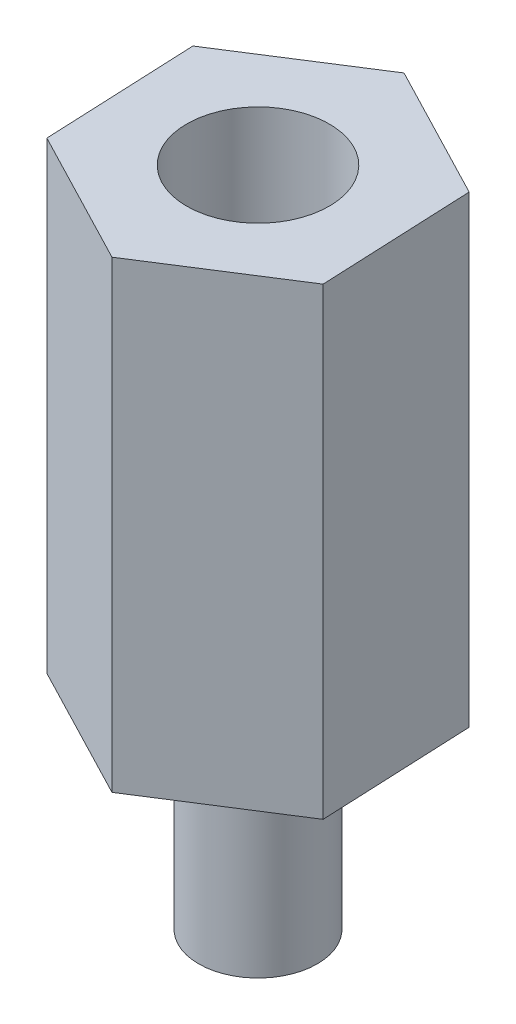
ISO-10303-21;
HEADER;
FILE_DESCRIPTION(('STEP AP214'),'2;1');
FILE_NAME('part.step','',(''),(''),'','','');
FILE_SCHEMA(('AUTOMOTIVE_DESIGN { 1 0 10303 214 1 1 1 1 }'));
ENDSEC;
DATA;
#1=APPLICATION_CONTEXT('core data for automotive mechanical design processes');
#2=APPLICATION_PROTOCOL_DEFINITION('international standard','automotive_design',2000,#1);
#3=PRODUCT_CONTEXT('',#1,'mechanical');
#4=PRODUCT('Part','Part','',(#3));
#5=PRODUCT_RELATED_PRODUCT_CATEGORY('part','',(#4));
#6=PRODUCT_DEFINITION_FORMATION('','',#4);
#7=PRODUCT_DEFINITION_CONTEXT('part definition',#1,'design');
#8=PRODUCT_DEFINITION('design','',#6,#7);
#9=PRODUCT_DEFINITION_SHAPE('','',#8);
#10=(LENGTH_UNIT() NAMED_UNIT(*) SI_UNIT(.MILLI.,.METRE.));
#11=(NAMED_UNIT(*) PLANE_ANGLE_UNIT() SI_UNIT($,.RADIAN.));
#12=(NAMED_UNIT(*) SI_UNIT($,.STERADIAN.) SOLID_ANGLE_UNIT());
#13=UNCERTAINTY_MEASURE_WITH_UNIT(LENGTH_MEASURE(1.E-05),#10,'distance_accuracy_value','');
#14=(GEOMETRIC_REPRESENTATION_CONTEXT(3) GLOBAL_UNCERTAINTY_ASSIGNED_CONTEXT((#13)) GLOBAL_UNIT_ASSIGNED_CONTEXT((#10,
#11,#12)) REPRESENTATION_CONTEXT('',''));
#15=CARTESIAN_POINT('',(0.,0.,0.));
#16=DIRECTION('',(0.,0.,1.));
#17=DIRECTION('',(1.,0.,0.));
#18=AXIS2_PLACEMENT_3D('',#15,#16,#17);
#19=CARTESIAN_POINT('',(3.25269135479195,0.,1.69139950449178));
#20=DIRECTION('',(0.,1.,0.));
#21=DIRECTION('',(0.,0.,1.));
#22=AXIS2_PLACEMENT_3D('',#19,#20,#21);
#23=PLANE('',#22);
#24=DIRECTION('',(0.843151590654727,0.,-0.537675920212542));
#25=VECTOR('',#24,1.);
#26=CARTESIAN_POINT('',(0.16155073855768,0.,3.66261309616574));
#27=LINE('',#26,#25);
#28=CARTESIAN_POINT('',(0.16155073855768,0.,3.66261309616574));
#29=VERTEX_POINT('',#28);
#30=CARTESIAN_POINT('',(3.25269135479195,0.,1.69139950449178));
#31=VERTEX_POINT('',#30);
#32=EDGE_CURVE('E117',#29,#31,#27,.T.);
#33=ORIENTED_EDGE('',*,*,#32,.F.);
#34=DIRECTION('',(0.8872168012346,0.,0.461352736641981));
#35=VECTOR('',#34,1.);
#36=CARTESIAN_POINT('',(-3.09114061623427,0.,1.97121359167397));
#37=LINE('',#36,#35);
#38=CARTESIAN_POINT('',(-3.09114061623427,0.,1.97121359167397));
#39=VERTEX_POINT('',#38);
#40=EDGE_CURVE('E77',#39,#29,#37,.T.);
#41=ORIENTED_EDGE('',*,*,#40,.F.);
#42=DIRECTION('',(0.044065210579872,0.,0.999028656854523));
#43=VECTOR('',#42,1.);
#44=CARTESIAN_POINT('',(-3.25269135479196,0.,-1.69139950449178));
#45=LINE('',#44,#43);
#46=CARTESIAN_POINT('',(-3.25269135479196,0.,-1.69139950449178));
#47=VERTEX_POINT('',#46);
#48=EDGE_CURVE('E71',#47,#39,#45,.T.);
#49=ORIENTED_EDGE('',*,*,#48,.F.);
#50=DIRECTION('',(-0.843151590654727,0.,0.537675920212542));
#51=VECTOR('',#50,1.);
#52=CARTESIAN_POINT('',(-0.161550738557683,0.,-3.66261309616575));
#53=LINE('',#52,#51);
#54=CARTESIAN_POINT('',(-0.161550738557683,0.,-3.66261309616575));
#55=VERTEX_POINT('',#54);
#56=EDGE_CURVE('E107',#55,#47,#53,.T.);
#57=ORIENTED_EDGE('',*,*,#56,.F.);
#58=DIRECTION('',(-0.887216801234599,0.,-0.461352736641983));
#59=VECTOR('',#58,1.);
#60=CARTESIAN_POINT('',(3.09114061623427,0.,-1.97121359167397));
#61=LINE('',#60,#59);
#62=CARTESIAN_POINT('',(3.09114061623427,0.,-1.97121359167397));
#63=VERTEX_POINT('',#62);
#64=EDGE_CURVE('E123',#63,#55,#61,.T.);
#65=ORIENTED_EDGE('',*,*,#64,.F.);
#66=DIRECTION('',(-0.044065210579872,0.,-0.999028656854523));
#67=VECTOR('',#66,1.);
#68=CARTESIAN_POINT('',(3.25269135479195,0.,1.69139950449178));
#69=LINE('',#68,#67);
#70=EDGE_CURVE('E120',#31,#63,#69,.T.);
#71=ORIENTED_EDGE('',*,*,#70,.F.);
#72=EDGE_LOOP('',(#33,#41,#49,#57,#65,#71));
#73=FACE_BOUND('',#72,.T.);
#74=CARTESIAN_POINT('',(0.,0.,0.));
#75=DIRECTION('',(0.,1.,0.));
#76=DIRECTION('',(0.,0.,1.));
#77=AXIS2_PLACEMENT_3D('',#74,#75,#76);
#78=CIRCLE('',#77,1.4224);
#79=CARTESIAN_POINT('',(0.,0.,1.4224));
#80=VERTEX_POINT('',#79);
#81=EDGE_CURVE('E11',#80,#80,#78,.F.);
#82=ORIENTED_EDGE('',*,*,#81,.F.);
#83=EDGE_LOOP('',(#82));
#84=FACE_BOUND('',#83,.T.);
#85=ADVANCED_FACE('F31',(#73,#84),#23,.F.);
#86=CARTESIAN_POINT('',(0.16155073855768,11.1125,3.66261309616574));
#87=DIRECTION('',(-0.537675920212541,0.,-0.843151590654727));
#88=DIRECTION('',(-0.843151590654727,0.,0.537675920212542));
#89=AXIS2_PLACEMENT_3D('',#86,#87,#88);
#90=PLANE('',#89);
#91=ORIENTED_EDGE('',*,*,#32,.T.);
#92=DIRECTION('',(0.,-1.,0.));
#93=VECTOR('',#92,1.);
#94=CARTESIAN_POINT('',(3.25269135479195,11.1125,1.69139950449178));
#95=LINE('',#94,#93);
#96=CARTESIAN_POINT('',(3.25269135479195,11.1125,1.69139950449178));
#97=VERTEX_POINT('',#96);
#98=EDGE_CURVE('E40',#97,#31,#95,.T.);
#99=ORIENTED_EDGE('',*,*,#98,.F.);
#100=DIRECTION('',(0.843151590654727,0.,-0.537675920212542));
#101=VECTOR('',#100,1.);
#102=CARTESIAN_POINT('',(0.16155073855768,11.1125,3.66261309616574));
#103=LINE('',#102,#101);
#104=CARTESIAN_POINT('',(0.16155073855768,11.1125,3.66261309616574));
#105=VERTEX_POINT('',#104);
#106=EDGE_CURVE('E128',#105,#97,#103,.T.);
#107=ORIENTED_EDGE('',*,*,#106,.F.);
#108=DIRECTION('',(0.,-1.,0.));
#109=VECTOR('',#108,1.);
#110=CARTESIAN_POINT('',(0.16155073855768,11.1125,3.66261309616574));
#111=LINE('',#110,#109);
#112=EDGE_CURVE('E113',#105,#29,#111,.T.);
#113=ORIENTED_EDGE('',*,*,#112,.T.);
#114=EDGE_LOOP('',(#91,#99,#107,#113));
#115=FACE_BOUND('',#114,.T.);
#116=ADVANCED_FACE('F33',(#115),#90,.F.);
#117=CARTESIAN_POINT('',(3.25269135479195,11.1125,1.69139950449178));
#118=DIRECTION('',(-0.999028656854523,0.,0.044065210579872));
#119=DIRECTION('',(0.044065210579872,0.,0.999028656854523));
#120=AXIS2_PLACEMENT_3D('',#117,#118,#119);
#121=PLANE('',#120);
#122=ORIENTED_EDGE('',*,*,#70,.T.);
#123=DIRECTION('',(0.,-1.,0.));
#124=VECTOR('',#123,1.);
#125=CARTESIAN_POINT('',(3.09114061623427,11.1125,-1.97121359167397));
#126=LINE('',#125,#124);
#127=CARTESIAN_POINT('',(3.09114061623427,11.1125,-1.97121359167397));
#128=VERTEX_POINT('',#127);
#129=EDGE_CURVE('E132',#128,#63,#126,.T.);
#130=ORIENTED_EDGE('',*,*,#129,.F.);
#131=DIRECTION('',(-0.044065210579872,0.,-0.999028656854523));
#132=VECTOR('',#131,1.);
#133=CARTESIAN_POINT('',(3.25269135479195,11.1125,1.69139950449178));
#134=LINE('',#133,#132);
#135=EDGE_CURVE('E86',#97,#128,#134,.T.);
#136=ORIENTED_EDGE('',*,*,#135,.F.);
#137=ORIENTED_EDGE('',*,*,#98,.T.);
#138=EDGE_LOOP('',(#122,#130,#136,#137));
#139=FACE_BOUND('',#138,.T.);
#140=ADVANCED_FACE('F135',(#139),#121,.F.);
#141=CARTESIAN_POINT('',(3.09114061623427,11.1125,-1.97121359167397));
#142=DIRECTION('',(-0.461352736641983,0.,0.887216801234599));
#143=DIRECTION('',(0.887216801234599,0.,0.461352736641983));
#144=AXIS2_PLACEMENT_3D('',#141,#142,#143);
#145=PLANE('',#144);
#146=ORIENTED_EDGE('',*,*,#64,.T.);
#147=DIRECTION('',(0.,-1.,0.));
#148=VECTOR('',#147,1.);
#149=CARTESIAN_POINT('',(-0.161550738557683,11.1125,-3.66261309616575));
#150=LINE('',#149,#148);
#151=CARTESIAN_POINT('',(-0.161550738557683,11.1125,-3.66261309616575));
#152=VERTEX_POINT('',#151);
#153=EDGE_CURVE('E108',#152,#55,#150,.T.);
#154=ORIENTED_EDGE('',*,*,#153,.F.);
#155=DIRECTION('',(-0.887216801234599,0.,-0.461352736641983));
#156=VECTOR('',#155,1.);
#157=CARTESIAN_POINT('',(3.09114061623427,11.1125,-1.97121359167397));
#158=LINE('',#157,#156);
#159=EDGE_CURVE('E99',#128,#152,#158,.T.);
#160=ORIENTED_EDGE('',*,*,#159,.F.);
#161=ORIENTED_EDGE('',*,*,#129,.T.);
#162=EDGE_LOOP('',(#146,#154,#160,#161));
#163=FACE_BOUND('',#162,.T.);
#164=ADVANCED_FACE('F143',(#163),#145,.F.);
#165=CARTESIAN_POINT('',(-0.161550738557683,11.1125,-3.66261309616575));
#166=DIRECTION('',(0.537675920212542,0.,0.843151590654727));
#167=DIRECTION('',(0.843151590654727,0.,-0.537675920212542));
#168=AXIS2_PLACEMENT_3D('',#165,#166,#167);
#169=PLANE('',#168);
#170=ORIENTED_EDGE('',*,*,#56,.T.);
#171=DIRECTION('',(0.,-1.,0.));
#172=VECTOR('',#171,1.);
#173=CARTESIAN_POINT('',(-3.25269135479196,11.1125,-1.69139950449178));
#174=LINE('',#173,#172);
#175=CARTESIAN_POINT('',(-3.25269135479196,11.1125,-1.69139950449178));
#176=VERTEX_POINT('',#175);
#177=EDGE_CURVE('E104',#176,#47,#174,.T.);
#178=ORIENTED_EDGE('',*,*,#177,.F.);
#179=DIRECTION('',(-0.843151590654727,0.,0.537675920212542));
#180=VECTOR('',#179,1.);
#181=CARTESIAN_POINT('',(-0.161550738557683,11.1125,-3.66261309616575));
#182=LINE('',#181,#180);
#183=EDGE_CURVE('E93',#152,#176,#182,.T.);
#184=ORIENTED_EDGE('',*,*,#183,.F.);
#185=ORIENTED_EDGE('',*,*,#153,.T.);
#186=EDGE_LOOP('',(#170,#178,#184,#185));
#187=FACE_BOUND('',#186,.T.);
#188=ADVANCED_FACE('F105',(#187),#169,.F.);
#189=CARTESIAN_POINT('',(-3.25269135479196,11.1125,-1.69139950449178));
#190=DIRECTION('',(0.999028656854523,0.,-0.044065210579872));
#191=DIRECTION('',(-0.044065210579872,0.,-0.999028656854523));
#192=AXIS2_PLACEMENT_3D('',#189,#190,#191);
#193=PLANE('',#192);
#194=ORIENTED_EDGE('',*,*,#48,.T.);
#195=DIRECTION('',(0.,-1.,0.));
#196=VECTOR('',#195,1.);
#197=CARTESIAN_POINT('',(-3.09114061623427,11.1125,1.97121359167397));
#198=LINE('',#197,#196);
#199=CARTESIAN_POINT('',(-3.09114061623427,11.1125,1.97121359167397));
#200=VERTEX_POINT('',#199);
#201=EDGE_CURVE('E109',#200,#39,#198,.T.);
#202=ORIENTED_EDGE('',*,*,#201,.F.);
#203=DIRECTION('',(0.044065210579872,0.,0.999028656854523));
#204=VECTOR('',#203,1.);
#205=CARTESIAN_POINT('',(-3.25269135479196,11.1125,-1.69139950449178));
#206=LINE('',#205,#204);
#207=EDGE_CURVE('E97',#176,#200,#206,.T.);
#208=ORIENTED_EDGE('',*,*,#207,.F.);
#209=ORIENTED_EDGE('',*,*,#177,.T.);
#210=EDGE_LOOP('',(#194,#202,#208,#209));
#211=FACE_BOUND('',#210,.T.);
#212=ADVANCED_FACE('F111',(#211),#193,.F.);
#213=CARTESIAN_POINT('',(-3.09114061623427,11.1125,1.97121359167397));
#214=DIRECTION('',(0.461352736641981,0.,-0.8872168012346));
#215=DIRECTION('',(-0.8872168012346,0.,-0.461352736641981));
#216=AXIS2_PLACEMENT_3D('',#213,#214,#215);
#217=PLANE('',#216);
#218=ORIENTED_EDGE('',*,*,#40,.T.);
#219=ORIENTED_EDGE('',*,*,#112,.F.);
#220=DIRECTION('',(0.8872168012346,0.,0.461352736641981));
#221=VECTOR('',#220,1.);
#222=CARTESIAN_POINT('',(-3.09114061623427,11.1125,1.97121359167397));
#223=LINE('',#222,#221);
#224=EDGE_CURVE('E48',#200,#105,#223,.T.);
#225=ORIENTED_EDGE('',*,*,#224,.F.);
#226=ORIENTED_EDGE('',*,*,#201,.T.);
#227=EDGE_LOOP('',(#218,#219,#225,#226));
#228=FACE_BOUND('',#227,.T.);
#229=ADVANCED_FACE('F167',(#228),#217,.F.);
#230=CARTESIAN_POINT('',(3.25269135479195,11.1125,1.69139950449178));
#231=DIRECTION('',(0.,1.,0.));
#232=DIRECTION('',(0.,0.,1.));
#233=AXIS2_PLACEMENT_3D('',#230,#231,#232);
#234=PLANE('',#233);
#235=CARTESIAN_POINT('',(0.,11.1125,0.));
#236=DIRECTION('',(0.,1.,0.));
#237=DIRECTION('',(0.,0.,1.));
#238=AXIS2_PLACEMENT_3D('',#235,#236,#237);
#239=CIRCLE('',#238,1.70891155008251);
#240=CARTESIAN_POINT('',(0.,11.1125,1.70891155008251));
#241=VERTEX_POINT('',#240);
#242=EDGE_CURVE('E150',#241,#241,#239,.T.);
#243=ORIENTED_EDGE('',*,*,#242,.F.);
#244=EDGE_LOOP('',(#243));
#245=FACE_BOUND('',#244,.T.);
#246=ORIENTED_EDGE('',*,*,#106,.T.);
#247=ORIENTED_EDGE('',*,*,#135,.T.);
#248=ORIENTED_EDGE('',*,*,#159,.T.);
#249=ORIENTED_EDGE('',*,*,#183,.T.);
#250=ORIENTED_EDGE('',*,*,#207,.T.);
#251=ORIENTED_EDGE('',*,*,#224,.T.);
#252=EDGE_LOOP('',(#246,#247,#248,#249,#250,#251));
#253=FACE_BOUND('',#252,.T.);
#254=ADVANCED_FACE('F95',(#245,#253),#234,.T.);
#255=CARTESIAN_POINT('',(0.,-4.7625,0.));
#256=DIRECTION('',(0.,1.,0.));
#257=DIRECTION('',(0.,0.,1.));
#258=AXIS2_PLACEMENT_3D('',#255,#256,#257);
#259=CYLINDRICAL_SURFACE('',#258,1.4224);
#260=CARTESIAN_POINT('',(0.,-4.7625,0.));
#261=DIRECTION('',(0.,-1.,0.));
#262=DIRECTION('',(0.,0.,-1.));
#263=AXIS2_PLACEMENT_3D('',#260,#261,#262);
#264=CIRCLE('',#263,1.4224);
#265=CARTESIAN_POINT('',(0.,-4.7625,-1.4224));
#266=VERTEX_POINT('',#265);
#267=EDGE_CURVE('E121',#266,#266,#264,.T.);
#268=ORIENTED_EDGE('',*,*,#267,.F.);
#269=EDGE_LOOP('',(#268));
#270=FACE_BOUND('',#269,.T.);
#271=ORIENTED_EDGE('',*,*,#81,.T.);
#272=EDGE_LOOP('',(#271));
#273=FACE_BOUND('',#272,.T.);
#274=ADVANCED_FACE('F166',(#270,#273),#259,.T.);
#275=CARTESIAN_POINT('',(0.,-4.7625,0.));
#276=DIRECTION('',(0.,-1.,0.));
#277=DIRECTION('',(0.,0.,-1.));
#278=AXIS2_PLACEMENT_3D('',#275,#276,#277);
#279=PLANE('',#278);
#280=ORIENTED_EDGE('',*,*,#267,.T.);
#281=EDGE_LOOP('',(#280));
#282=FACE_BOUND('',#281,.T.);
#283=ADVANCED_FACE('F161',(#282),#279,.T.);
#284=CARTESIAN_POINT('',(0.,4.7625,0.));
#285=DIRECTION('',(0.,1.,0.));
#286=DIRECTION('',(0.,0.,1.));
#287=AXIS2_PLACEMENT_3D('',#284,#285,#286);
#288=CYLINDRICAL_SURFACE('',#287,1.70891155008251);
#289=CARTESIAN_POINT('',(0.,4.7625,0.));
#290=DIRECTION('',(0.,1.,0.));
#291=DIRECTION('',(0.,0.,1.));
#292=AXIS2_PLACEMENT_3D('',#289,#290,#291);
#293=CIRCLE('',#292,1.70891155008251);
#294=CARTESIAN_POINT('',(0.,4.7625,1.70891155008251));
#295=VERTEX_POINT('',#294);
#296=EDGE_CURVE('E149',#295,#295,#293,.T.);
#297=ORIENTED_EDGE('',*,*,#296,.F.);
#298=EDGE_LOOP('',(#297));
#299=FACE_BOUND('',#298,.T.);
#300=ORIENTED_EDGE('',*,*,#242,.T.);
#301=EDGE_LOOP('',(#300));
#302=FACE_BOUND('',#301,.T.);
#303=ADVANCED_FACE('F158',(#299,#302),#288,.F.);
#304=CARTESIAN_POINT('',(0.,4.7625,0.));
#305=DIRECTION('',(0.,1.,0.));
#306=DIRECTION('',(0.,0.,1.));
#307=AXIS2_PLACEMENT_3D('',#304,#305,#306);
#308=PLANE('',#307);
#309=ORIENTED_EDGE('',*,*,#296,.T.);
#310=EDGE_LOOP('',(#309));
#311=FACE_BOUND('',#310,.T.);
#312=ADVANCED_FACE('F156',(#311),#308,.T.);
#313=CLOSED_SHELL('',(#85,#116,#140,#164,#188,#212,#229,#254,#274,#283,#303,#312));
#314=MANIFOLD_SOLID_BREP('B2',#313);
#315=ADVANCED_BREP_SHAPE_REPRESENTATION('',(#18,#314),#14);
#316=SHAPE_DEFINITION_REPRESENTATION(#9,#315);
ENDSEC;
END-ISO-10303-21;
